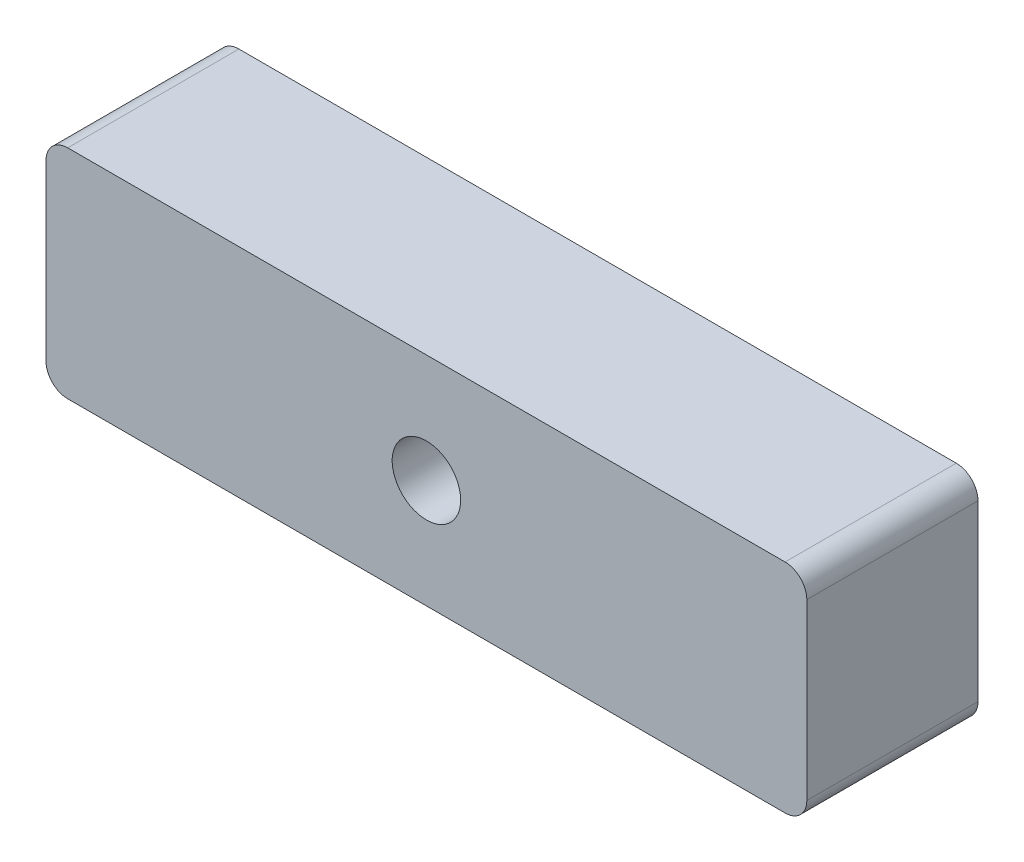
ISO-10303-21;
HEADER;
FILE_DESCRIPTION(('STEP AP214'),'2;1');
FILE_NAME('part.step','',(''),(''),'','','');
FILE_SCHEMA(('AUTOMOTIVE_DESIGN { 1 0 10303 214 1 1 1 1 }'));
ENDSEC;
DATA;
#1=APPLICATION_CONTEXT('core data for automotive mechanical design processes');
#2=APPLICATION_PROTOCOL_DEFINITION('international standard','automotive_design',2000,#1);
#3=PRODUCT_CONTEXT('',#1,'mechanical');
#4=PRODUCT('Part','Part','',(#3));
#5=PRODUCT_RELATED_PRODUCT_CATEGORY('part','',(#4));
#6=PRODUCT_DEFINITION_FORMATION('','',#4);
#7=PRODUCT_DEFINITION_CONTEXT('part definition',#1,'design');
#8=PRODUCT_DEFINITION('design','',#6,#7);
#9=PRODUCT_DEFINITION_SHAPE('','',#8);
#10=(LENGTH_UNIT() NAMED_UNIT(*) SI_UNIT(.MILLI.,.METRE.));
#11=(NAMED_UNIT(*) PLANE_ANGLE_UNIT() SI_UNIT($,.RADIAN.));
#12=(NAMED_UNIT(*) SI_UNIT($,.STERADIAN.) SOLID_ANGLE_UNIT());
#13=UNCERTAINTY_MEASURE_WITH_UNIT(LENGTH_MEASURE(1.E-05),#10,'distance_accuracy_value','');
#14=(GEOMETRIC_REPRESENTATION_CONTEXT(3) GLOBAL_UNCERTAINTY_ASSIGNED_CONTEXT((#13)) GLOBAL_UNIT_ASSIGNED_CONTEXT((#10,
#11,#12)) REPRESENTATION_CONTEXT('',''));
#15=CARTESIAN_POINT('',(0.,0.,0.));
#16=DIRECTION('',(0.,0.,1.));
#17=DIRECTION('',(1.,0.,0.));
#18=AXIS2_PLACEMENT_3D('',#15,#16,#17);
#19=CARTESIAN_POINT('',(-41.91,12.7,20.));
#20=DIRECTION('',(0.,1.,0.));
#21=DIRECTION('',(0.,0.,1.));
#22=AXIS2_PLACEMENT_3D('',#19,#20,#21);
#23=PLANE('',#22);
#24=DIRECTION('',(1.,0.,0.));
#25=VECTOR('',#24,1.);
#26=CARTESIAN_POINT('',(-41.91,12.7,0.));
#27=LINE('',#26,#25);
#28=CARTESIAN_POINT('',(-41.91,12.7,0.));
#29=VERTEX_POINT('',#28);
#30=CARTESIAN_POINT('',(41.91,12.7,0.));
#31=VERTEX_POINT('',#30);
#32=EDGE_CURVE('E137',#29,#31,#27,.T.);
#33=ORIENTED_EDGE('',*,*,#32,.F.);
#34=DIRECTION('',(0.,0.,-1.));
#35=VECTOR('',#34,1.);
#36=CARTESIAN_POINT('',(-41.91,12.7,20.));
#37=LINE('',#36,#35);
#38=CARTESIAN_POINT('',(-41.91,12.7,20.));
#39=VERTEX_POINT('',#38);
#40=EDGE_CURVE('E11',#39,#29,#37,.T.);
#41=ORIENTED_EDGE('',*,*,#40,.F.);
#42=DIRECTION('',(1.,0.,0.));
#43=VECTOR('',#42,1.);
#44=CARTESIAN_POINT('',(-41.91,12.7,20.));
#45=LINE('',#44,#43);
#46=CARTESIAN_POINT('',(41.91,12.7,20.));
#47=VERTEX_POINT('',#46);
#48=EDGE_CURVE('E156',#39,#47,#45,.T.);
#49=ORIENTED_EDGE('',*,*,#48,.T.);
#50=DIRECTION('',(0.,0.,-1.));
#51=VECTOR('',#50,1.);
#52=CARTESIAN_POINT('',(41.91,12.7,20.));
#53=LINE('',#52,#51);
#54=EDGE_CURVE('E44',#47,#31,#53,.T.);
#55=ORIENTED_EDGE('',*,*,#54,.T.);
#56=EDGE_LOOP('',(#33,#41,#49,#55));
#57=FACE_BOUND('',#56,.T.);
#58=ADVANCED_FACE('F41',(#57),#23,.T.);
#59=CARTESIAN_POINT('',(-41.91,10.16,20.));
#60=DIRECTION('',(0.,0.,-1.));
#61=DIRECTION('',(-1.,0.,0.));
#62=AXIS2_PLACEMENT_3D('',#59,#60,#61);
#63=CYLINDRICAL_SURFACE('',#62,2.54);
#64=CARTESIAN_POINT('',(-41.91,10.16,0.));
#65=DIRECTION('',(0.,0.,-1.));
#66=DIRECTION('',(-1.,0.,0.));
#67=AXIS2_PLACEMENT_3D('',#64,#65,#66);
#68=CIRCLE('',#67,2.54);
#69=CARTESIAN_POINT('',(-44.45,10.16,0.));
#70=VERTEX_POINT('',#69);
#71=EDGE_CURVE('E154',#70,#29,#68,.T.);
#72=ORIENTED_EDGE('',*,*,#71,.F.);
#73=DIRECTION('',(0.,0.,-1.));
#74=VECTOR('',#73,1.);
#75=CARTESIAN_POINT('',(-44.45,10.16,20.));
#76=LINE('',#75,#74);
#77=CARTESIAN_POINT('',(-44.45,10.16,20.));
#78=VERTEX_POINT('',#77);
#79=EDGE_CURVE('E50',#78,#70,#76,.T.);
#80=ORIENTED_EDGE('',*,*,#79,.F.);
#81=CARTESIAN_POINT('',(-41.91,10.16,20.));
#82=DIRECTION('',(0.,0.,-1.));
#83=DIRECTION('',(-1.,0.,0.));
#84=AXIS2_PLACEMENT_3D('',#81,#82,#83);
#85=CIRCLE('',#84,2.54);
#86=EDGE_CURVE('E126',#78,#39,#85,.T.);
#87=ORIENTED_EDGE('',*,*,#86,.T.);
#88=ORIENTED_EDGE('',*,*,#40,.T.);
#89=EDGE_LOOP('',(#72,#80,#87,#88));
#90=FACE_BOUND('',#89,.T.);
#91=ADVANCED_FACE('F171',(#90),#63,.T.);
#92=CARTESIAN_POINT('',(-44.45,-10.16,20.));
#93=DIRECTION('',(-1.,0.,0.));
#94=DIRECTION('',(0.,0.,1.));
#95=AXIS2_PLACEMENT_3D('',#92,#93,#94);
#96=PLANE('',#95);
#97=DIRECTION('',(0.,1.,0.));
#98=VECTOR('',#97,1.);
#99=CARTESIAN_POINT('',(-44.45,-10.16,0.));
#100=LINE('',#99,#98);
#101=CARTESIAN_POINT('',(-44.45,-10.16,0.));
#102=VERTEX_POINT('',#101);
#103=EDGE_CURVE('E115',#102,#70,#100,.T.);
#104=ORIENTED_EDGE('',*,*,#103,.F.);
#105=DIRECTION('',(0.,0.,-1.));
#106=VECTOR('',#105,1.);
#107=CARTESIAN_POINT('',(-44.45,-10.16,20.));
#108=LINE('',#107,#106);
#109=CARTESIAN_POINT('',(-44.45,-10.16,20.));
#110=VERTEX_POINT('',#109);
#111=EDGE_CURVE('E110',#110,#102,#108,.T.);
#112=ORIENTED_EDGE('',*,*,#111,.F.);
#113=DIRECTION('',(0.,1.,0.));
#114=VECTOR('',#113,1.);
#115=CARTESIAN_POINT('',(-44.45,-10.16,20.));
#116=LINE('',#115,#114);
#117=EDGE_CURVE('E113',#110,#78,#116,.T.);
#118=ORIENTED_EDGE('',*,*,#117,.T.);
#119=ORIENTED_EDGE('',*,*,#79,.T.);
#120=EDGE_LOOP('',(#104,#112,#118,#119));
#121=FACE_BOUND('',#120,.T.);
#122=ADVANCED_FACE('F112',(#121),#96,.T.);
#123=CARTESIAN_POINT('',(-41.91,-10.16,20.));
#124=DIRECTION('',(0.,0.,-1.));
#125=DIRECTION('',(-1.,0.,0.));
#126=AXIS2_PLACEMENT_3D('',#123,#124,#125);
#127=CYLINDRICAL_SURFACE('',#126,2.54);
#128=CARTESIAN_POINT('',(-41.91,-10.16,0.));
#129=DIRECTION('',(0.,0.,-1.));
#130=DIRECTION('',(-1.,0.,0.));
#131=AXIS2_PLACEMENT_3D('',#128,#129,#130);
#132=CIRCLE('',#131,2.54);
#133=CARTESIAN_POINT('',(-41.91,-12.7,0.));
#134=VERTEX_POINT('',#133);
#135=EDGE_CURVE('E151',#134,#102,#132,.T.);
#136=ORIENTED_EDGE('',*,*,#135,.F.);
#137=DIRECTION('',(0.,0.,-1.));
#138=VECTOR('',#137,1.);
#139=CARTESIAN_POINT('',(-41.91,-12.7,20.));
#140=LINE('',#139,#138);
#141=CARTESIAN_POINT('',(-41.91,-12.7,20.));
#142=VERTEX_POINT('',#141);
#143=EDGE_CURVE('E120',#142,#134,#140,.T.);
#144=ORIENTED_EDGE('',*,*,#143,.F.);
#145=CARTESIAN_POINT('',(-41.91,-10.16,20.));
#146=DIRECTION('',(0.,0.,-1.));
#147=DIRECTION('',(-1.,0.,0.));
#148=AXIS2_PLACEMENT_3D('',#145,#146,#147);
#149=CIRCLE('',#148,2.54);
#150=EDGE_CURVE('E125',#142,#110,#149,.T.);
#151=ORIENTED_EDGE('',*,*,#150,.T.);
#152=ORIENTED_EDGE('',*,*,#111,.T.);
#153=EDGE_LOOP('',(#136,#144,#151,#152));
#154=FACE_BOUND('',#153,.T.);
#155=ADVANCED_FACE('F128',(#154),#127,.T.);
#156=CARTESIAN_POINT('',(-41.91,-12.7,20.));
#157=DIRECTION('',(0.,1.,0.));
#158=DIRECTION('',(0.,0.,1.));
#159=AXIS2_PLACEMENT_3D('',#156,#157,#158);
#160=PLANE('',#159);
#161=DIRECTION('',(1.,0.,0.));
#162=VECTOR('',#161,1.);
#163=CARTESIAN_POINT('',(-41.91,-12.7,0.));
#164=LINE('',#163,#162);
#165=CARTESIAN_POINT('',(41.91,-12.7,0.));
#166=VERTEX_POINT('',#165);
#167=EDGE_CURVE('E149',#134,#166,#164,.T.);
#168=ORIENTED_EDGE('',*,*,#167,.T.);
#169=DIRECTION('',(0.,0.,-1.));
#170=VECTOR('',#169,1.);
#171=CARTESIAN_POINT('',(41.91,-12.7,20.));
#172=LINE('',#171,#170);
#173=CARTESIAN_POINT('',(41.91,-12.7,20.));
#174=VERTEX_POINT('',#173);
#175=EDGE_CURVE('E160',#174,#166,#172,.T.);
#176=ORIENTED_EDGE('',*,*,#175,.F.);
#177=DIRECTION('',(1.,0.,0.));
#178=VECTOR('',#177,1.);
#179=CARTESIAN_POINT('',(-41.91,-12.7,20.));
#180=LINE('',#179,#178);
#181=EDGE_CURVE('E130',#142,#174,#180,.T.);
#182=ORIENTED_EDGE('',*,*,#181,.F.);
#183=ORIENTED_EDGE('',*,*,#143,.T.);
#184=EDGE_LOOP('',(#168,#176,#182,#183));
#185=FACE_BOUND('',#184,.T.);
#186=ADVANCED_FACE('F184',(#185),#160,.F.);
#187=CARTESIAN_POINT('',(41.91,-10.16,20.));
#188=DIRECTION('',(0.,0.,-1.));
#189=DIRECTION('',(-1.,0.,0.));
#190=AXIS2_PLACEMENT_3D('',#187,#188,#189);
#191=CYLINDRICAL_SURFACE('',#190,2.54);
#192=CARTESIAN_POINT('',(41.91,-10.16,0.));
#193=DIRECTION('',(0.,0.,1.));
#194=DIRECTION('',(1.,0.,0.));
#195=AXIS2_PLACEMENT_3D('',#192,#193,#194);
#196=CIRCLE('',#195,2.54);
#197=CARTESIAN_POINT('',(44.45,-10.16,0.));
#198=VERTEX_POINT('',#197);
#199=EDGE_CURVE('E147',#166,#198,#196,.T.);
#200=ORIENTED_EDGE('',*,*,#199,.T.);
#201=DIRECTION('',(0.,0.,-1.));
#202=VECTOR('',#201,1.);
#203=CARTESIAN_POINT('',(44.45,-10.16,20.));
#204=LINE('',#203,#202);
#205=CARTESIAN_POINT('',(44.45,-10.16,20.));
#206=VERTEX_POINT('',#205);
#207=EDGE_CURVE('E163',#206,#198,#204,.T.);
#208=ORIENTED_EDGE('',*,*,#207,.F.);
#209=CARTESIAN_POINT('',(41.91,-10.16,20.));
#210=DIRECTION('',(0.,0.,1.));
#211=DIRECTION('',(1.,0.,0.));
#212=AXIS2_PLACEMENT_3D('',#209,#210,#211);
#213=CIRCLE('',#212,2.54);
#214=EDGE_CURVE('E132',#174,#206,#213,.T.);
#215=ORIENTED_EDGE('',*,*,#214,.F.);
#216=ORIENTED_EDGE('',*,*,#175,.T.);
#217=EDGE_LOOP('',(#200,#208,#215,#216));
#218=FACE_BOUND('',#217,.T.);
#219=ADVANCED_FACE('F187',(#218),#191,.T.);
#220=CARTESIAN_POINT('',(44.45,-10.16,20.));
#221=DIRECTION('',(-1.,0.,0.));
#222=DIRECTION('',(0.,0.,1.));
#223=AXIS2_PLACEMENT_3D('',#220,#221,#222);
#224=PLANE('',#223);
#225=DIRECTION('',(0.,1.,0.));
#226=VECTOR('',#225,1.);
#227=CARTESIAN_POINT('',(44.45,-10.16,0.));
#228=LINE('',#227,#226);
#229=CARTESIAN_POINT('',(44.45,10.16,0.));
#230=VERTEX_POINT('',#229);
#231=EDGE_CURVE('E144',#198,#230,#228,.T.);
#232=ORIENTED_EDGE('',*,*,#231,.T.);
#233=DIRECTION('',(0.,0.,-1.));
#234=VECTOR('',#233,1.);
#235=CARTESIAN_POINT('',(44.45,10.16,20.));
#236=LINE('',#235,#234);
#237=CARTESIAN_POINT('',(44.45,10.16,20.));
#238=VERTEX_POINT('',#237);
#239=EDGE_CURVE('E165',#238,#230,#236,.T.);
#240=ORIENTED_EDGE('',*,*,#239,.F.);
#241=DIRECTION('',(0.,1.,0.));
#242=VECTOR('',#241,1.);
#243=CARTESIAN_POINT('',(44.45,-10.16,20.));
#244=LINE('',#243,#242);
#245=EDGE_CURVE('E222',#206,#238,#244,.T.);
#246=ORIENTED_EDGE('',*,*,#245,.F.);
#247=ORIENTED_EDGE('',*,*,#207,.T.);
#248=EDGE_LOOP('',(#232,#240,#246,#247));
#249=FACE_BOUND('',#248,.T.);
#250=ADVANCED_FACE('F191',(#249),#224,.F.);
#251=CARTESIAN_POINT('',(41.91,10.16,20.));
#252=DIRECTION('',(0.,0.,-1.));
#253=DIRECTION('',(-1.,0.,0.));
#254=AXIS2_PLACEMENT_3D('',#251,#252,#253);
#255=CYLINDRICAL_SURFACE('',#254,2.54);
#256=CARTESIAN_POINT('',(41.91,10.16,0.));
#257=DIRECTION('',(0.,0.,-1.));
#258=DIRECTION('',(-1.,0.,0.));
#259=AXIS2_PLACEMENT_3D('',#256,#257,#258);
#260=CIRCLE('',#259,2.54);
#261=EDGE_CURVE('E140',#31,#230,#260,.T.);
#262=ORIENTED_EDGE('',*,*,#261,.F.);
#263=ORIENTED_EDGE('',*,*,#54,.F.);
#264=CARTESIAN_POINT('',(41.91,10.16,20.));
#265=DIRECTION('',(0.,0.,-1.));
#266=DIRECTION('',(-1.,0.,0.));
#267=AXIS2_PLACEMENT_3D('',#264,#265,#266);
#268=CIRCLE('',#267,2.54);
#269=EDGE_CURVE('E220',#47,#238,#268,.T.);
#270=ORIENTED_EDGE('',*,*,#269,.T.);
#271=ORIENTED_EDGE('',*,*,#239,.T.);
#272=EDGE_LOOP('',(#262,#263,#270,#271));
#273=FACE_BOUND('',#272,.T.);
#274=ADVANCED_FACE('F167',(#273),#255,.T.);
#275=CARTESIAN_POINT('',(41.91,10.16,20.));
#276=DIRECTION('',(0.,0.,-1.));
#277=DIRECTION('',(-1.,0.,0.));
#278=AXIS2_PLACEMENT_3D('',#275,#276,#277);
#279=PLANE('',#278);
#280=CARTESIAN_POINT('',(0.,0.,20.));
#281=DIRECTION('',(0.,0.,1.));
#282=DIRECTION('',(1.,0.,0.));
#283=AXIS2_PLACEMENT_3D('',#280,#281,#282);
#284=CIRCLE('',#283,4.);
#285=CARTESIAN_POINT('',(4.,0.,20.));
#286=VERTEX_POINT('',#285);
#287=EDGE_CURVE('E215',#286,#286,#284,.T.);
#288=ORIENTED_EDGE('',*,*,#287,.F.);
#289=EDGE_LOOP('',(#288));
#290=FACE_BOUND('',#289,.T.);
#291=ORIENTED_EDGE('',*,*,#48,.F.);
#292=ORIENTED_EDGE('',*,*,#86,.F.);
#293=ORIENTED_EDGE('',*,*,#117,.F.);
#294=ORIENTED_EDGE('',*,*,#150,.F.);
#295=ORIENTED_EDGE('',*,*,#181,.T.);
#296=ORIENTED_EDGE('',*,*,#214,.T.);
#297=ORIENTED_EDGE('',*,*,#245,.T.);
#298=ORIENTED_EDGE('',*,*,#269,.F.);
#299=EDGE_LOOP('',(#291,#292,#293,#294,#295,#296,#297,#298));
#300=FACE_BOUND('',#299,.T.);
#301=ADVANCED_FACE('F124',(#290,#300),#279,.F.);
#302=CARTESIAN_POINT('',(41.91,10.16,0.));
#303=DIRECTION('',(0.,0.,-1.));
#304=DIRECTION('',(-1.,0.,0.));
#305=AXIS2_PLACEMENT_3D('',#302,#303,#304);
#306=PLANE('',#305);
#307=CARTESIAN_POINT('',(0.,0.,0.));
#308=DIRECTION('',(0.,0.,1.));
#309=DIRECTION('',(1.,0.,0.));
#310=AXIS2_PLACEMENT_3D('',#307,#308,#309);
#311=CIRCLE('',#310,4.);
#312=CARTESIAN_POINT('',(4.,0.,0.));
#313=VERTEX_POINT('',#312);
#314=EDGE_CURVE('E141',#313,#313,#311,.T.);
#315=ORIENTED_EDGE('',*,*,#314,.T.);
#316=EDGE_LOOP('',(#315));
#317=FACE_BOUND('',#316,.T.);
#318=ORIENTED_EDGE('',*,*,#32,.T.);
#319=ORIENTED_EDGE('',*,*,#261,.T.);
#320=ORIENTED_EDGE('',*,*,#231,.F.);
#321=ORIENTED_EDGE('',*,*,#199,.F.);
#322=ORIENTED_EDGE('',*,*,#167,.F.);
#323=ORIENTED_EDGE('',*,*,#135,.T.);
#324=ORIENTED_EDGE('',*,*,#103,.T.);
#325=ORIENTED_EDGE('',*,*,#71,.T.);
#326=EDGE_LOOP('',(#318,#319,#320,#321,#322,#323,#324,#325));
#327=FACE_BOUND('',#326,.T.);
#328=ADVANCED_FACE('F170',(#317,#327),#306,.T.);
#329=CARTESIAN_POINT('',(0.,0.,0.));
#330=DIRECTION('',(0.,0.,1.));
#331=DIRECTION('',(1.,0.,0.));
#332=AXIS2_PLACEMENT_3D('',#329,#330,#331);
#333=CYLINDRICAL_SURFACE('',#332,4.);
#334=ORIENTED_EDGE('',*,*,#314,.F.);
#335=EDGE_LOOP('',(#334));
#336=FACE_BOUND('',#335,.T.);
#337=ORIENTED_EDGE('',*,*,#287,.T.);
#338=EDGE_LOOP('',(#337));
#339=FACE_BOUND('',#338,.T.);
#340=ADVANCED_FACE('F203',(#336,#339),#333,.F.);
#341=CLOSED_SHELL('',(#58,#91,#122,#155,#186,#219,#250,#274,#301,#328,#340));
#342=MANIFOLD_SOLID_BREP('B2',#341);
#343=ADVANCED_BREP_SHAPE_REPRESENTATION('',(#18,#342),#14);
#344=SHAPE_DEFINITION_REPRESENTATION(#9,#343);
ENDSEC;
END-ISO-10303-21;
